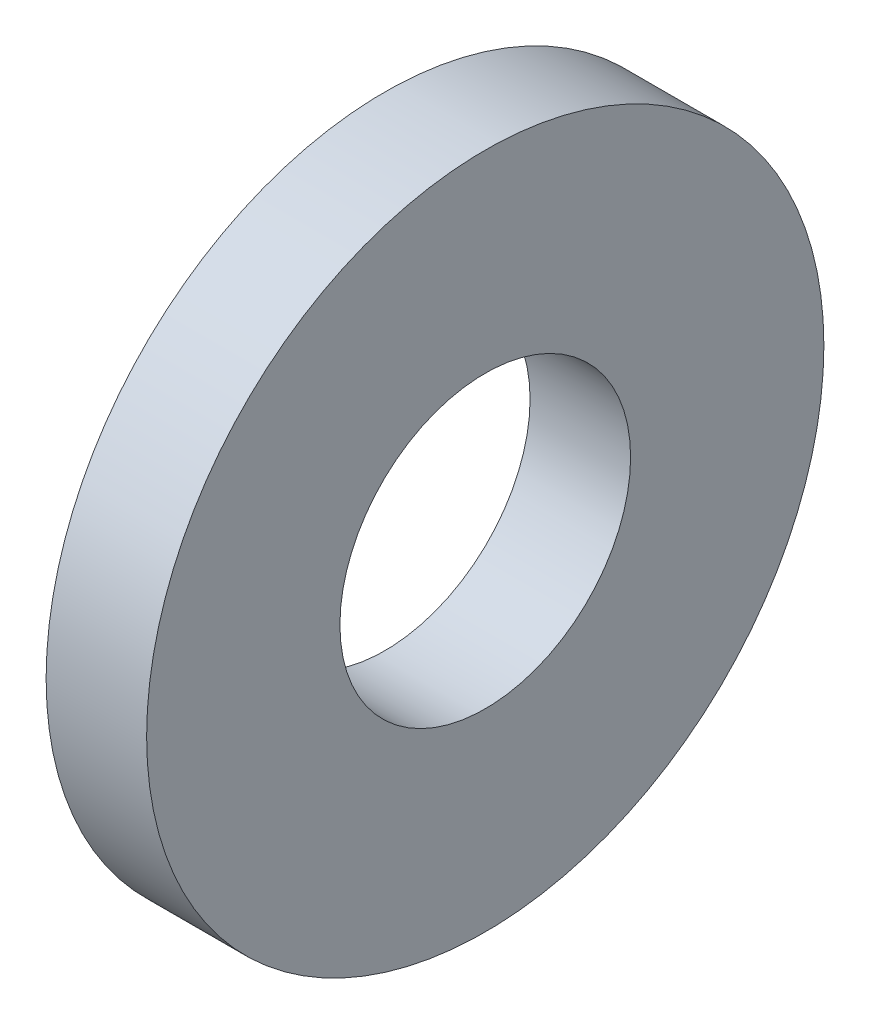
ISO-10303-21;
HEADER;
FILE_DESCRIPTION(('STEP AP214'),'2;1');
FILE_NAME('part.step','',(''),(''),'','','');
FILE_SCHEMA(('AUTOMOTIVE_DESIGN { 1 0 10303 214 1 1 1 1 }'));
ENDSEC;
DATA;
#1=APPLICATION_CONTEXT('core data for automotive mechanical design processes');
#2=APPLICATION_PROTOCOL_DEFINITION('international standard','automotive_design',2000,#1);
#3=PRODUCT_CONTEXT('',#1,'mechanical');
#4=PRODUCT('Part','Part','',(#3));
#5=PRODUCT_RELATED_PRODUCT_CATEGORY('part','',(#4));
#6=PRODUCT_DEFINITION_FORMATION('','',#4);
#7=PRODUCT_DEFINITION_CONTEXT('part definition',#1,'design');
#8=PRODUCT_DEFINITION('design','',#6,#7);
#9=PRODUCT_DEFINITION_SHAPE('','',#8);
#10=(LENGTH_UNIT() NAMED_UNIT(*) SI_UNIT(.MILLI.,.METRE.));
#11=(NAMED_UNIT(*) PLANE_ANGLE_UNIT() SI_UNIT($,.RADIAN.));
#12=(NAMED_UNIT(*) SI_UNIT($,.STERADIAN.) SOLID_ANGLE_UNIT());
#13=UNCERTAINTY_MEASURE_WITH_UNIT(LENGTH_MEASURE(1.E-05),#10,'distance_accuracy_value','');
#14=(GEOMETRIC_REPRESENTATION_CONTEXT(3) GLOBAL_UNCERTAINTY_ASSIGNED_CONTEXT((#13)) GLOBAL_UNIT_ASSIGNED_CONTEXT((#10,
#11,#12)) REPRESENTATION_CONTEXT('',''));
#15=CARTESIAN_POINT('',(0.,0.,0.));
#16=DIRECTION('',(0.,0.,1.));
#17=DIRECTION('',(1.,0.,0.));
#18=AXIS2_PLACEMENT_3D('',#15,#16,#17);
#19=CARTESIAN_POINT('',(1.651,0.,0.));
#20=DIRECTION('',(1.,0.,0.));
#21=DIRECTION('',(0.,0.,-1.));
#22=AXIS2_PLACEMENT_3D('',#19,#20,#21);
#23=PLANE('',#22);
#24=CARTESIAN_POINT('',(1.651,0.,0.));
#25=DIRECTION('',(1.,0.,0.));
#26=DIRECTION('',(0.,0.,-1.));
#27=AXIS2_PLACEMENT_3D('',#24,#25,#26);
#28=CIRCLE('',#27,5.5626);
#29=CARTESIAN_POINT('',(1.651,0.,-5.5626));
#30=VERTEX_POINT('',#29);
#31=EDGE_CURVE('E10',#30,#30,#28,.T.);
#32=ORIENTED_EDGE('',*,*,#31,.T.);
#33=EDGE_LOOP('',(#32));
#34=FACE_BOUND('',#33,.T.);
#35=CARTESIAN_POINT('',(1.651,0.,0.));
#36=DIRECTION('',(1.,0.,0.));
#37=DIRECTION('',(0.,0.,-1.));
#38=AXIS2_PLACEMENT_3D('',#35,#36,#37);
#39=CIRCLE('',#38,2.3876);
#40=CARTESIAN_POINT('',(1.651,0.,-2.3876));
#41=VERTEX_POINT('',#40);
#42=EDGE_CURVE('E41',#41,#41,#39,.T.);
#43=ORIENTED_EDGE('',*,*,#42,.F.);
#44=EDGE_LOOP('',(#43));
#45=FACE_BOUND('',#44,.T.);
#46=ADVANCED_FACE('F30',(#34,#45),#23,.T.);
#47=CARTESIAN_POINT('',(0.,0.,0.));
#48=DIRECTION('',(1.,0.,0.));
#49=DIRECTION('',(0.,0.,-1.));
#50=AXIS2_PLACEMENT_3D('',#47,#48,#49);
#51=PLANE('',#50);
#52=CARTESIAN_POINT('',(0.,0.,0.));
#53=DIRECTION('',(1.,0.,0.));
#54=DIRECTION('',(0.,0.,-1.));
#55=AXIS2_PLACEMENT_3D('',#52,#53,#54);
#56=CIRCLE('',#55,5.5626);
#57=CARTESIAN_POINT('',(0.,0.,-5.5626));
#58=VERTEX_POINT('',#57);
#59=EDGE_CURVE('E34',#58,#58,#56,.T.);
#60=ORIENTED_EDGE('',*,*,#59,.F.);
#61=EDGE_LOOP('',(#60));
#62=FACE_BOUND('',#61,.T.);
#63=CARTESIAN_POINT('',(0.,0.,0.));
#64=DIRECTION('',(1.,0.,0.));
#65=DIRECTION('',(0.,0.,-1.));
#66=AXIS2_PLACEMENT_3D('',#63,#64,#65);
#67=CIRCLE('',#66,2.3876);
#68=CARTESIAN_POINT('',(0.,0.,-2.3876));
#69=VERTEX_POINT('',#68);
#70=EDGE_CURVE('E43',#69,#69,#67,.T.);
#71=ORIENTED_EDGE('',*,*,#70,.T.);
#72=EDGE_LOOP('',(#71));
#73=FACE_BOUND('',#72,.T.);
#74=ADVANCED_FACE('F53',(#62,#73),#51,.F.);
#75=CARTESIAN_POINT('',(1.651,0.,0.));
#76=DIRECTION('',(-1.,0.,0.));
#77=DIRECTION('',(0.,0.,1.));
#78=AXIS2_PLACEMENT_3D('',#75,#76,#77);
#79=CYLINDRICAL_SURFACE('',#78,5.5626);
#80=ORIENTED_EDGE('',*,*,#31,.F.);
#81=EDGE_LOOP('',(#80));
#82=FACE_BOUND('',#81,.T.);
#83=ORIENTED_EDGE('',*,*,#59,.T.);
#84=EDGE_LOOP('',(#83));
#85=FACE_BOUND('',#84,.T.);
#86=ADVANCED_FACE('F32',(#82,#85),#79,.T.);
#87=CARTESIAN_POINT('',(1.651,0.,0.));
#88=DIRECTION('',(-1.,0.,0.));
#89=DIRECTION('',(0.,0.,1.));
#90=AXIS2_PLACEMENT_3D('',#87,#88,#89);
#91=CYLINDRICAL_SURFACE('',#90,2.3876);
#92=ORIENTED_EDGE('',*,*,#42,.T.);
#93=EDGE_LOOP('',(#92));
#94=FACE_BOUND('',#93,.T.);
#95=ORIENTED_EDGE('',*,*,#70,.F.);
#96=EDGE_LOOP('',(#95));
#97=FACE_BOUND('',#96,.T.);
#98=ADVANCED_FACE('F49',(#94,#97),#91,.F.);
#99=CLOSED_SHELL('',(#46,#74,#86,#98));
#100=MANIFOLD_SOLID_BREP('B2',#99);
#101=ADVANCED_BREP_SHAPE_REPRESENTATION('',(#18,#100),#14);
#102=SHAPE_DEFINITION_REPRESENTATION(#9,#101);
ENDSEC;
END-ISO-10303-21;
